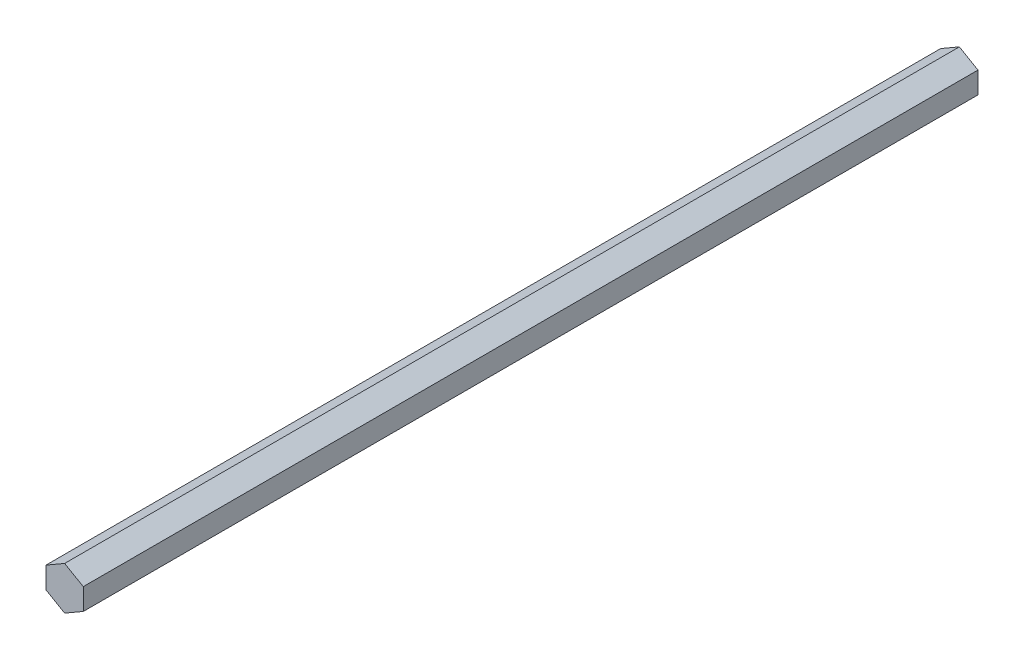
ISO-10303-21;
HEADER;
FILE_DESCRIPTION(('STEP AP214'),'2;1');
FILE_NAME('part.step','',(''),(''),'','','');
FILE_SCHEMA(('AUTOMOTIVE_DESIGN { 1 0 10303 214 1 1 1 1 }'));
ENDSEC;
DATA;
#1=APPLICATION_CONTEXT('core data for automotive mechanical design processes');
#2=APPLICATION_PROTOCOL_DEFINITION('international standard','automotive_design',2000,#1);
#3=PRODUCT_CONTEXT('',#1,'mechanical');
#4=PRODUCT('Part','Part','',(#3));
#5=PRODUCT_RELATED_PRODUCT_CATEGORY('part','',(#4));
#6=PRODUCT_DEFINITION_FORMATION('','',#4);
#7=PRODUCT_DEFINITION_CONTEXT('part definition',#1,'design');
#8=PRODUCT_DEFINITION('design','',#6,#7);
#9=PRODUCT_DEFINITION_SHAPE('','',#8);
#10=(LENGTH_UNIT() NAMED_UNIT(*) SI_UNIT(.MILLI.,.METRE.));
#11=(NAMED_UNIT(*) PLANE_ANGLE_UNIT() SI_UNIT($,.RADIAN.));
#12=(NAMED_UNIT(*) SI_UNIT($,.STERADIAN.) SOLID_ANGLE_UNIT());
#13=UNCERTAINTY_MEASURE_WITH_UNIT(LENGTH_MEASURE(1.E-05),#10,'distance_accuracy_value','');
#14=(GEOMETRIC_REPRESENTATION_CONTEXT(3) GLOBAL_UNCERTAINTY_ASSIGNED_CONTEXT((#13)) GLOBAL_UNIT_ASSIGNED_CONTEXT((#10,
#11,#12)) REPRESENTATION_CONTEXT('',''));
#15=CARTESIAN_POINT('',(0.,0.,0.));
#16=DIRECTION('',(0.,0.,1.));
#17=DIRECTION('',(1.,0.,0.));
#18=AXIS2_PLACEMENT_3D('',#15,#16,#17);
#19=CARTESIAN_POINT('',(-6.34999999999999,3.66617420935413,152.4));
#20=DIRECTION('',(0.5,-0.866025403784439,0.));
#21=DIRECTION('',(0.866025403784439,0.5,0.));
#22=AXIS2_PLACEMENT_3D('',#19,#20,#21);
#23=PLANE('',#22);
#24=DIRECTION('',(-0.866025403784439,-0.5,0.));
#25=VECTOR('',#24,1.);
#26=CARTESIAN_POINT('',(-6.34999999999999,3.66617420935413,-152.4));
#27=LINE('',#26,#25);
#28=CARTESIAN_POINT('',(0.,7.33234841870825,-152.4));
#29=VERTEX_POINT('',#28);
#30=CARTESIAN_POINT('',(-6.34999999999999,3.66617420935413,-152.4));
#31=VERTEX_POINT('',#30);
#32=EDGE_CURVE('E116',#29,#31,#27,.T.);
#33=ORIENTED_EDGE('',*,*,#32,.T.);
#34=DIRECTION('',(0.,0.,-1.));
#35=VECTOR('',#34,1.);
#36=CARTESIAN_POINT('',(-6.34999999999999,3.66617420935413,152.4));
#37=LINE('',#36,#35);
#38=CARTESIAN_POINT('',(-6.34999999999999,3.66617420935413,152.4));
#39=VERTEX_POINT('',#38);
#40=EDGE_CURVE('E11',#39,#31,#37,.T.);
#41=ORIENTED_EDGE('',*,*,#40,.F.);
#42=DIRECTION('',(-0.866025403784439,-0.5,0.));
#43=VECTOR('',#42,1.);
#44=CARTESIAN_POINT('',(-6.34999999999999,3.66617420935413,152.4));
#45=LINE('',#44,#43);
#46=CARTESIAN_POINT('',(0.,7.33234841870825,152.4));
#47=VERTEX_POINT('',#46);
#48=EDGE_CURVE('E126',#47,#39,#45,.T.);
#49=ORIENTED_EDGE('',*,*,#48,.F.);
#50=DIRECTION('',(0.,0.,-1.));
#51=VECTOR('',#50,1.);
#52=CARTESIAN_POINT('',(0.,7.33234841870825,152.4));
#53=LINE('',#52,#51);
#54=EDGE_CURVE('E112',#47,#29,#53,.T.);
#55=ORIENTED_EDGE('',*,*,#54,.T.);
#56=EDGE_LOOP('',(#33,#41,#49,#55));
#57=FACE_BOUND('',#56,.T.);
#58=ADVANCED_FACE('F32',(#57),#23,.F.);
#59=CARTESIAN_POINT('',(-6.35,-3.66617420935412,152.4));
#60=DIRECTION('',(1.,0.,0.));
#61=DIRECTION('',(0.,1.,0.));
#62=AXIS2_PLACEMENT_3D('',#59,#60,#61);
#63=PLANE('',#62);
#64=DIRECTION('',(0.,-1.,0.));
#65=VECTOR('',#64,1.);
#66=CARTESIAN_POINT('',(-6.35,-3.66617420935412,-152.4));
#67=LINE('',#66,#65);
#68=CARTESIAN_POINT('',(-6.35,-3.66617420935412,-152.4));
#69=VERTEX_POINT('',#68);
#70=EDGE_CURVE('E119',#31,#69,#67,.T.);
#71=ORIENTED_EDGE('',*,*,#70,.T.);
#72=DIRECTION('',(0.,0.,-1.));
#73=VECTOR('',#72,1.);
#74=CARTESIAN_POINT('',(-6.35,-3.66617420935412,152.4));
#75=LINE('',#74,#73);
#76=CARTESIAN_POINT('',(-6.35,-3.66617420935412,152.4));
#77=VERTEX_POINT('',#76);
#78=EDGE_CURVE('E40',#77,#69,#75,.T.);
#79=ORIENTED_EDGE('',*,*,#78,.F.);
#80=DIRECTION('',(0.,-1.,0.));
#81=VECTOR('',#80,1.);
#82=CARTESIAN_POINT('',(-6.35,-3.66617420935412,152.4));
#83=LINE('',#82,#81);
#84=EDGE_CURVE('E85',#39,#77,#83,.T.);
#85=ORIENTED_EDGE('',*,*,#84,.F.);
#86=ORIENTED_EDGE('',*,*,#40,.T.);
#87=EDGE_LOOP('',(#71,#79,#85,#86));
#88=FACE_BOUND('',#87,.T.);
#89=ADVANCED_FACE('F150',(#88),#63,.F.);
#90=CARTESIAN_POINT('',(0.,-7.33234841870825,152.4));
#91=DIRECTION('',(0.5,0.866025403784439,0.));
#92=DIRECTION('',(-0.866025403784439,0.5,0.));
#93=AXIS2_PLACEMENT_3D('',#90,#91,#92);
#94=PLANE('',#93);
#95=DIRECTION('',(0.866025403784439,-0.5,0.));
#96=VECTOR('',#95,1.);
#97=CARTESIAN_POINT('',(0.,-7.33234841870825,-152.4));
#98=LINE('',#97,#96);
#99=CARTESIAN_POINT('',(0.,-7.33234841870825,-152.4));
#100=VERTEX_POINT('',#99);
#101=EDGE_CURVE('E121',#69,#100,#98,.T.);
#102=ORIENTED_EDGE('',*,*,#101,.T.);
#103=DIRECTION('',(0.,0.,-1.));
#104=VECTOR('',#103,1.);
#105=CARTESIAN_POINT('',(0.,-7.33234841870825,152.4));
#106=LINE('',#105,#104);
#107=CARTESIAN_POINT('',(0.,-7.33234841870825,152.4));
#108=VERTEX_POINT('',#107);
#109=EDGE_CURVE('E107',#108,#100,#106,.T.);
#110=ORIENTED_EDGE('',*,*,#109,.F.);
#111=DIRECTION('',(0.866025403784439,-0.5,0.));
#112=VECTOR('',#111,1.);
#113=CARTESIAN_POINT('',(0.,-7.33234841870825,152.4));
#114=LINE('',#113,#112);
#115=EDGE_CURVE('E98',#77,#108,#114,.T.);
#116=ORIENTED_EDGE('',*,*,#115,.F.);
#117=ORIENTED_EDGE('',*,*,#78,.T.);
#118=EDGE_LOOP('',(#102,#110,#116,#117));
#119=FACE_BOUND('',#118,.T.);
#120=ADVANCED_FACE('F132',(#119),#94,.F.);
#121=CARTESIAN_POINT('',(6.35,-3.66617420935413,152.4));
#122=DIRECTION('',(-0.5,0.866025403784439,0.));
#123=DIRECTION('',(-0.866025403784438,-0.5,0.));
#124=AXIS2_PLACEMENT_3D('',#121,#122,#123);
#125=PLANE('',#124);
#126=DIRECTION('',(0.866025403784439,0.5,0.));
#127=VECTOR('',#126,1.);
#128=CARTESIAN_POINT('',(6.35,-3.66617420935413,-152.4));
#129=LINE('',#128,#127);
#130=CARTESIAN_POINT('',(6.35,-3.66617420935413,-152.4));
#131=VERTEX_POINT('',#130);
#132=EDGE_CURVE('E106',#100,#131,#129,.T.);
#133=ORIENTED_EDGE('',*,*,#132,.T.);
#134=DIRECTION('',(0.,0.,-1.));
#135=VECTOR('',#134,1.);
#136=CARTESIAN_POINT('',(6.35,-3.66617420935413,152.4));
#137=LINE('',#136,#135);
#138=CARTESIAN_POINT('',(6.35,-3.66617420935413,152.4));
#139=VERTEX_POINT('',#138);
#140=EDGE_CURVE('E103',#139,#131,#137,.T.);
#141=ORIENTED_EDGE('',*,*,#140,.F.);
#142=DIRECTION('',(0.866025403784439,0.5,0.));
#143=VECTOR('',#142,1.);
#144=CARTESIAN_POINT('',(6.35,-3.66617420935413,152.4));
#145=LINE('',#144,#143);
#146=EDGE_CURVE('E92',#108,#139,#145,.T.);
#147=ORIENTED_EDGE('',*,*,#146,.F.);
#148=ORIENTED_EDGE('',*,*,#109,.T.);
#149=EDGE_LOOP('',(#133,#141,#147,#148));
#150=FACE_BOUND('',#149,.T.);
#151=ADVANCED_FACE('F104',(#150),#125,.F.);
#152=CARTESIAN_POINT('',(6.35,3.66617420935412,152.4));
#153=DIRECTION('',(-1.,0.,0.));
#154=DIRECTION('',(0.,0.,1.));
#155=AXIS2_PLACEMENT_3D('',#152,#153,#154);
#156=PLANE('',#155);
#157=DIRECTION('',(0.,1.,0.));
#158=VECTOR('',#157,1.);
#159=CARTESIAN_POINT('',(6.35,3.66617420935412,-152.4));
#160=LINE('',#159,#158);
#161=CARTESIAN_POINT('',(6.35,3.66617420935412,-152.4));
#162=VERTEX_POINT('',#161);
#163=EDGE_CURVE('E71',#131,#162,#160,.T.);
#164=ORIENTED_EDGE('',*,*,#163,.T.);
#165=DIRECTION('',(0.,0.,-1.));
#166=VECTOR('',#165,1.);
#167=CARTESIAN_POINT('',(6.35,3.66617420935412,152.4));
#168=LINE('',#167,#166);
#169=CARTESIAN_POINT('',(6.35,3.66617420935412,152.4));
#170=VERTEX_POINT('',#169);
#171=EDGE_CURVE('E108',#170,#162,#168,.T.);
#172=ORIENTED_EDGE('',*,*,#171,.F.);
#173=DIRECTION('',(0.,1.,0.));
#174=VECTOR('',#173,1.);
#175=CARTESIAN_POINT('',(6.35,3.66617420935412,152.4));
#176=LINE('',#175,#174);
#177=EDGE_CURVE('E96',#139,#170,#176,.T.);
#178=ORIENTED_EDGE('',*,*,#177,.F.);
#179=ORIENTED_EDGE('',*,*,#140,.T.);
#180=EDGE_LOOP('',(#164,#172,#178,#179));
#181=FACE_BOUND('',#180,.T.);
#182=ADVANCED_FACE('F110',(#181),#156,.F.);
#183=CARTESIAN_POINT('',(0.,7.33234841870825,152.4));
#184=DIRECTION('',(-0.5,-0.866025403784439,0.));
#185=DIRECTION('',(0.866025403784439,-0.5,0.));
#186=AXIS2_PLACEMENT_3D('',#183,#184,#185);
#187=PLANE('',#186);
#188=DIRECTION('',(-0.866025403784438,0.5,0.));
#189=VECTOR('',#188,1.);
#190=CARTESIAN_POINT('',(0.,7.33234841870825,-152.4));
#191=LINE('',#190,#189);
#192=EDGE_CURVE('E77',#162,#29,#191,.T.);
#193=ORIENTED_EDGE('',*,*,#192,.T.);
#194=ORIENTED_EDGE('',*,*,#54,.F.);
#195=DIRECTION('',(-0.866025403784438,0.5,0.));
#196=VECTOR('',#195,1.);
#197=CARTESIAN_POINT('',(0.,7.33234841870825,152.4));
#198=LINE('',#197,#196);
#199=EDGE_CURVE('E48',#170,#47,#198,.T.);
#200=ORIENTED_EDGE('',*,*,#199,.F.);
#201=ORIENTED_EDGE('',*,*,#171,.T.);
#202=EDGE_LOOP('',(#193,#194,#200,#201));
#203=FACE_BOUND('',#202,.T.);
#204=ADVANCED_FACE('F139',(#203),#187,.F.);
#205=CARTESIAN_POINT('',(0.,0.,152.4));
#206=DIRECTION('',(0.,0.,-1.));
#207=DIRECTION('',(-1.,0.,0.));
#208=AXIS2_PLACEMENT_3D('',#205,#206,#207);
#209=PLANE('',#208);
#210=ORIENTED_EDGE('',*,*,#48,.T.);
#211=ORIENTED_EDGE('',*,*,#84,.T.);
#212=ORIENTED_EDGE('',*,*,#115,.T.);
#213=ORIENTED_EDGE('',*,*,#146,.T.);
#214=ORIENTED_EDGE('',*,*,#177,.T.);
#215=ORIENTED_EDGE('',*,*,#199,.T.);
#216=EDGE_LOOP('',(#210,#211,#212,#213,#214,#215));
#217=FACE_BOUND('',#216,.T.);
#218=ADVANCED_FACE('F94',(#217),#209,.F.);
#219=CARTESIAN_POINT('',(0.,0.,-152.4));
#220=DIRECTION('',(0.,0.,-1.));
#221=DIRECTION('',(-1.,0.,0.));
#222=AXIS2_PLACEMENT_3D('',#219,#220,#221);
#223=PLANE('',#222);
#224=ORIENTED_EDGE('',*,*,#32,.F.);
#225=ORIENTED_EDGE('',*,*,#192,.F.);
#226=ORIENTED_EDGE('',*,*,#163,.F.);
#227=ORIENTED_EDGE('',*,*,#132,.F.);
#228=ORIENTED_EDGE('',*,*,#101,.F.);
#229=ORIENTED_EDGE('',*,*,#70,.F.);
#230=EDGE_LOOP('',(#224,#225,#226,#227,#228,#229));
#231=FACE_BOUND('',#230,.T.);
#232=ADVANCED_FACE('F135',(#231),#223,.T.);
#233=CLOSED_SHELL('',(#58,#89,#120,#151,#182,#204,#218,#232));
#234=MANIFOLD_SOLID_BREP('B2',#233);
#235=ADVANCED_BREP_SHAPE_REPRESENTATION('',(#18,#234),#14);
#236=SHAPE_DEFINITION_REPRESENTATION(#9,#235);
ENDSEC;
END-ISO-10303-21;
